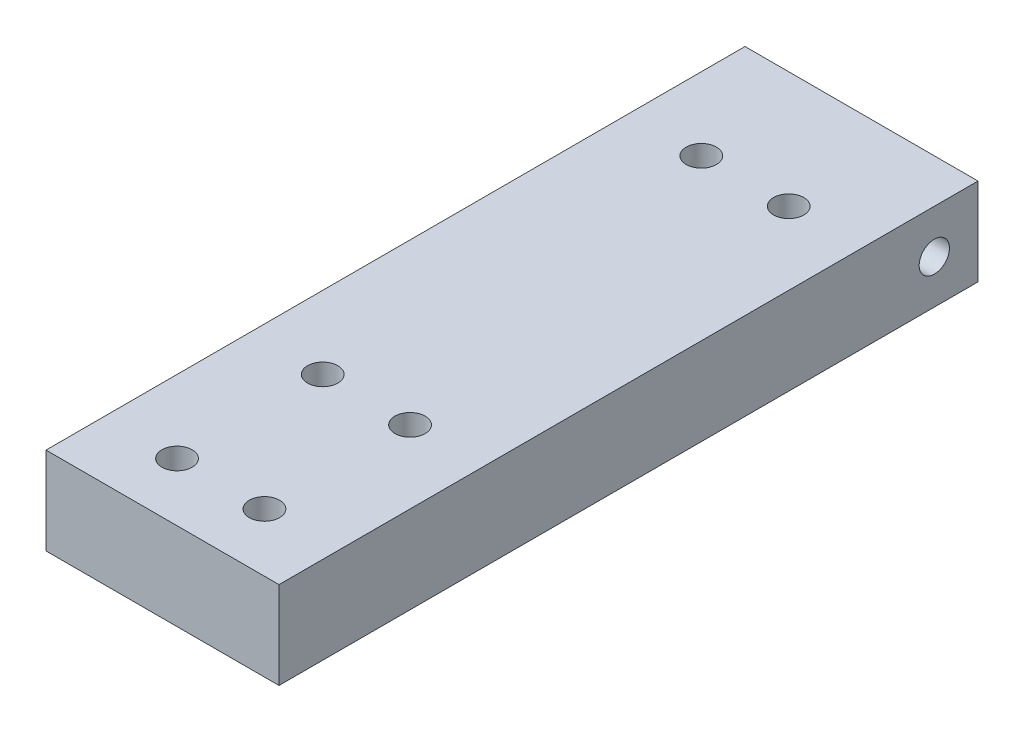
ISO-10303-21;
HEADER;
FILE_DESCRIPTION(('STEP AP214'),'2;1');
FILE_NAME('part.step','',(''),(''),'','','');
FILE_SCHEMA(('AUTOMOTIVE_DESIGN { 1 0 10303 214 1 1 1 1 }'));
ENDSEC;
DATA;
#1=APPLICATION_CONTEXT('core data for automotive mechanical design processes');
#2=APPLICATION_PROTOCOL_DEFINITION('international standard','automotive_design',2000,#1);
#3=PRODUCT_CONTEXT('',#1,'mechanical');
#4=PRODUCT('Part','Part','',(#3));
#5=PRODUCT_RELATED_PRODUCT_CATEGORY('part','',(#4));
#6=PRODUCT_DEFINITION_FORMATION('','',#4);
#7=PRODUCT_DEFINITION_CONTEXT('part definition',#1,'design');
#8=PRODUCT_DEFINITION('design','',#6,#7);
#9=PRODUCT_DEFINITION_SHAPE('','',#8);
#10=(LENGTH_UNIT() NAMED_UNIT(*) SI_UNIT(.MILLI.,.METRE.));
#11=(NAMED_UNIT(*) PLANE_ANGLE_UNIT() SI_UNIT($,.RADIAN.));
#12=(NAMED_UNIT(*) SI_UNIT($,.STERADIAN.) SOLID_ANGLE_UNIT());
#13=UNCERTAINTY_MEASURE_WITH_UNIT(LENGTH_MEASURE(1.E-05),#10,'distance_accuracy_value','');
#14=(GEOMETRIC_REPRESENTATION_CONTEXT(3) GLOBAL_UNCERTAINTY_ASSIGNED_CONTEXT((#13)) GLOBAL_UNIT_ASSIGNED_CONTEXT((#10,
#11,#12)) REPRESENTATION_CONTEXT('',''));
#15=CARTESIAN_POINT('',(0.,0.,0.));
#16=DIRECTION('',(0.,0.,1.));
#17=DIRECTION('',(1.,0.,0.));
#18=AXIS2_PLACEMENT_3D('',#15,#16,#17);
#19=CARTESIAN_POINT('',(0.,0.,152.4));
#20=DIRECTION('',(1.,0.,0.));
#21=DIRECTION('',(0.,0.,-1.));
#22=AXIS2_PLACEMENT_3D('',#19,#20,#21);
#23=PLANE('',#22);
#24=CARTESIAN_POINT('',(0.,9.525,9.525));
#25=DIRECTION('',(-1.,0.,0.));
#26=DIRECTION('',(0.,0.,1.));
#27=AXIS2_PLACEMENT_3D('',#24,#25,#26);
#28=CIRCLE('',#27,3.29999999999999);
#29=CARTESIAN_POINT('',(0.,9.525,12.825));
#30=VERTEX_POINT('',#29);
#31=EDGE_CURVE('E162',#30,#30,#28,.T.);
#32=ORIENTED_EDGE('',*,*,#31,.F.);
#33=EDGE_LOOP('',(#32));
#34=FACE_BOUND('',#33,.T.);
#35=DIRECTION('',(0.,-1.,0.));
#36=VECTOR('',#35,1.);
#37=CARTESIAN_POINT('',(0.,0.,0.));
#38=LINE('',#37,#36);
#39=CARTESIAN_POINT('',(0.,19.05,0.));
#40=VERTEX_POINT('',#39);
#41=CARTESIAN_POINT('',(0.,0.,0.));
#42=VERTEX_POINT('',#41);
#43=EDGE_CURVE('E98',#40,#42,#38,.T.);
#44=ORIENTED_EDGE('',*,*,#43,.T.);
#45=DIRECTION('',(0.,0.,-1.));
#46=VECTOR('',#45,1.);
#47=CARTESIAN_POINT('',(0.,0.,152.4));
#48=LINE('',#47,#46);
#49=CARTESIAN_POINT('',(0.,0.,152.4));
#50=VERTEX_POINT('',#49);
#51=EDGE_CURVE('E11',#50,#42,#48,.T.);
#52=ORIENTED_EDGE('',*,*,#51,.F.);
#53=DIRECTION('',(0.,-1.,0.));
#54=VECTOR('',#53,1.);
#55=CARTESIAN_POINT('',(0.,0.,152.4));
#56=LINE('',#55,#54);
#57=CARTESIAN_POINT('',(0.,19.05,152.4));
#58=VERTEX_POINT('',#57);
#59=EDGE_CURVE('E86',#58,#50,#56,.T.);
#60=ORIENTED_EDGE('',*,*,#59,.F.);
#61=DIRECTION('',(0.,0.,-1.));
#62=VECTOR('',#61,1.);
#63=CARTESIAN_POINT('',(0.,19.05,152.4));
#64=LINE('',#63,#62);
#65=EDGE_CURVE('E94',#58,#40,#64,.T.);
#66=ORIENTED_EDGE('',*,*,#65,.T.);
#67=EDGE_LOOP('',(#44,#52,#60,#66));
#68=FACE_BOUND('',#67,.T.);
#69=ADVANCED_FACE('F35',(#34,#68),#23,.F.);
#70=CARTESIAN_POINT('',(0.,0.,152.4));
#71=DIRECTION('',(0.,1.,0.));
#72=DIRECTION('',(0.,0.,1.));
#73=AXIS2_PLACEMENT_3D('',#70,#71,#72);
#74=PLANE('',#73);
#75=CARTESIAN_POINT('',(34.925,0.,25.4));
#76=DIRECTION('',(0.,-1.,0.));
#77=DIRECTION('',(0.,0.,-1.));
#78=AXIS2_PLACEMENT_3D('',#75,#76,#77);
#79=CIRCLE('',#78,3.29999999999999);
#80=CARTESIAN_POINT('',(34.925,0.,22.1));
#81=VERTEX_POINT('',#80);
#82=EDGE_CURVE('E174',#81,#81,#79,.T.);
#83=ORIENTED_EDGE('',*,*,#82,.F.);
#84=EDGE_LOOP('',(#83));
#85=FACE_BOUND('',#84,.T.);
#86=CARTESIAN_POINT('',(15.875,0.,25.4));
#87=DIRECTION('',(0.,-1.,0.));
#88=DIRECTION('',(0.,0.,-1.));
#89=AXIS2_PLACEMENT_3D('',#86,#87,#88);
#90=CIRCLE('',#89,3.29999999999999);
#91=CARTESIAN_POINT('',(15.875,0.,22.1));
#92=VERTEX_POINT('',#91);
#93=EDGE_CURVE('E168',#92,#92,#90,.T.);
#94=ORIENTED_EDGE('',*,*,#93,.F.);
#95=EDGE_LOOP('',(#94));
#96=FACE_BOUND('',#95,.T.);
#97=CARTESIAN_POINT('',(34.925,0.,139.7));
#98=DIRECTION('',(0.,-1.,0.));
#99=DIRECTION('',(0.,0.,-1.));
#100=AXIS2_PLACEMENT_3D('',#97,#98,#99);
#101=CIRCLE('',#100,5.5);
#102=CARTESIAN_POINT('',(34.925,0.,134.2));
#103=VERTEX_POINT('',#102);
#104=EDGE_CURVE('E156',#103,#103,#101,.T.);
#105=ORIENTED_EDGE('',*,*,#104,.F.);
#106=EDGE_LOOP('',(#105));
#107=FACE_BOUND('',#106,.T.);
#108=CARTESIAN_POINT('',(34.925,0.,107.95));
#109=DIRECTION('',(0.,-1.,0.));
#110=DIRECTION('',(0.,0.,-1.));
#111=AXIS2_PLACEMENT_3D('',#108,#109,#110);
#112=CIRCLE('',#111,5.5);
#113=CARTESIAN_POINT('',(34.925,0.,102.45));
#114=VERTEX_POINT('',#113);
#115=EDGE_CURVE('E144',#114,#114,#112,.T.);
#116=ORIENTED_EDGE('',*,*,#115,.F.);
#117=EDGE_LOOP('',(#116));
#118=FACE_BOUND('',#117,.T.);
#119=CARTESIAN_POINT('',(15.875,0.,107.95));
#120=DIRECTION('',(0.,-1.,0.));
#121=DIRECTION('',(0.,0.,-1.));
#122=AXIS2_PLACEMENT_3D('',#119,#120,#121);
#123=CIRCLE('',#122,5.5);
#124=CARTESIAN_POINT('',(15.875,0.,102.45));
#125=VERTEX_POINT('',#124);
#126=EDGE_CURVE('E132',#125,#125,#123,.T.);
#127=ORIENTED_EDGE('',*,*,#126,.F.);
#128=EDGE_LOOP('',(#127));
#129=FACE_BOUND('',#128,.T.);
#130=CARTESIAN_POINT('',(15.875,0.,139.7));
#131=DIRECTION('',(0.,-1.,0.));
#132=DIRECTION('',(0.,0.,-1.));
#133=AXIS2_PLACEMENT_3D('',#130,#131,#132);
#134=CIRCLE('',#133,5.5);
#135=CARTESIAN_POINT('',(15.875,0.,134.2));
#136=VERTEX_POINT('',#135);
#137=EDGE_CURVE('E120',#136,#136,#134,.T.);
#138=ORIENTED_EDGE('',*,*,#137,.F.);
#139=EDGE_LOOP('',(#138));
#140=FACE_BOUND('',#139,.T.);
#141=DIRECTION('',(1.,0.,0.));
#142=VECTOR('',#141,1.);
#143=CARTESIAN_POINT('',(0.,0.,0.));
#144=LINE('',#143,#142);
#145=CARTESIAN_POINT('',(50.8,0.,0.));
#146=VERTEX_POINT('',#145);
#147=EDGE_CURVE('E90',#42,#146,#144,.T.);
#148=ORIENTED_EDGE('',*,*,#147,.T.);
#149=DIRECTION('',(0.,0.,-1.));
#150=VECTOR('',#149,1.);
#151=CARTESIAN_POINT('',(50.8,0.,152.4));
#152=LINE('',#151,#150);
#153=CARTESIAN_POINT('',(50.8,0.,152.4));
#154=VERTEX_POINT('',#153);
#155=EDGE_CURVE('E43',#154,#146,#152,.T.);
#156=ORIENTED_EDGE('',*,*,#155,.F.);
#157=DIRECTION('',(1.,0.,0.));
#158=VECTOR('',#157,1.);
#159=CARTESIAN_POINT('',(0.,0.,152.4));
#160=LINE('',#159,#158);
#161=EDGE_CURVE('E81',#50,#154,#160,.T.);
#162=ORIENTED_EDGE('',*,*,#161,.F.);
#163=ORIENTED_EDGE('',*,*,#51,.T.);
#164=EDGE_LOOP('',(#148,#156,#162,#163));
#165=FACE_BOUND('',#164,.T.);
#166=ADVANCED_FACE('F89',(#85,#96,#107,#118,#129,#140,#165),#74,.F.);
#167=CARTESIAN_POINT('',(50.8,0.,152.4));
#168=DIRECTION('',(-1.,0.,0.));
#169=DIRECTION('',(0.,0.,1.));
#170=AXIS2_PLACEMENT_3D('',#167,#168,#169);
#171=PLANE('',#170);
#172=CARTESIAN_POINT('',(50.8,9.525,9.525));
#173=DIRECTION('',(-1.,0.,0.));
#174=DIRECTION('',(0.,0.,1.));
#175=AXIS2_PLACEMENT_3D('',#172,#173,#174);
#176=CIRCLE('',#175,3.29999999999999);
#177=CARTESIAN_POINT('',(50.8,9.525,12.825));
#178=VERTEX_POINT('',#177);
#179=EDGE_CURVE('E159',#178,#178,#176,.T.);
#180=ORIENTED_EDGE('',*,*,#179,.T.);
#181=EDGE_LOOP('',(#180));
#182=FACE_BOUND('',#181,.T.);
#183=DIRECTION('',(0.,1.,0.));
#184=VECTOR('',#183,1.);
#185=CARTESIAN_POINT('',(50.8,0.,0.));
#186=LINE('',#185,#184);
#187=CARTESIAN_POINT('',(50.8,19.05,0.));
#188=VERTEX_POINT('',#187);
#189=EDGE_CURVE('E68',#146,#188,#186,.T.);
#190=ORIENTED_EDGE('',*,*,#189,.T.);
#191=DIRECTION('',(0.,0.,-1.));
#192=VECTOR('',#191,1.);
#193=CARTESIAN_POINT('',(50.8,19.05,152.4));
#194=LINE('',#193,#192);
#195=CARTESIAN_POINT('',(50.8,19.05,152.4));
#196=VERTEX_POINT('',#195);
#197=EDGE_CURVE('E91',#196,#188,#194,.T.);
#198=ORIENTED_EDGE('',*,*,#197,.F.);
#199=DIRECTION('',(0.,1.,0.));
#200=VECTOR('',#199,1.);
#201=CARTESIAN_POINT('',(50.8,0.,152.4));
#202=LINE('',#201,#200);
#203=EDGE_CURVE('E84',#154,#196,#202,.T.);
#204=ORIENTED_EDGE('',*,*,#203,.F.);
#205=ORIENTED_EDGE('',*,*,#155,.T.);
#206=EDGE_LOOP('',(#190,#198,#204,#205));
#207=FACE_BOUND('',#206,.T.);
#208=ADVANCED_FACE('F92',(#182,#207),#171,.F.);
#209=CARTESIAN_POINT('',(0.,19.05,152.4));
#210=DIRECTION('',(0.,-1.,0.));
#211=DIRECTION('',(0.,0.,-1.));
#212=AXIS2_PLACEMENT_3D('',#209,#210,#211);
#213=PLANE('',#212);
#214=CARTESIAN_POINT('',(34.925,19.05,25.4));
#215=DIRECTION('',(0.,-1.,0.));
#216=DIRECTION('',(0.,0.,-1.));
#217=AXIS2_PLACEMENT_3D('',#214,#215,#216);
#218=CIRCLE('',#217,3.3);
#219=CARTESIAN_POINT('',(34.925,19.05,22.1));
#220=VERTEX_POINT('',#219);
#221=EDGE_CURVE('E171',#220,#220,#218,.T.);
#222=ORIENTED_EDGE('',*,*,#221,.T.);
#223=EDGE_LOOP('',(#222));
#224=FACE_BOUND('',#223,.T.);
#225=CARTESIAN_POINT('',(15.875,19.05,25.4));
#226=DIRECTION('',(0.,-1.,0.));
#227=DIRECTION('',(0.,0.,-1.));
#228=AXIS2_PLACEMENT_3D('',#225,#226,#227);
#229=CIRCLE('',#228,3.29999999999999);
#230=CARTESIAN_POINT('',(15.875,19.05,22.1));
#231=VERTEX_POINT('',#230);
#232=EDGE_CURVE('E165',#231,#231,#229,.T.);
#233=ORIENTED_EDGE('',*,*,#232,.T.);
#234=EDGE_LOOP('',(#233));
#235=FACE_BOUND('',#234,.T.);
#236=CARTESIAN_POINT('',(34.925,19.05,139.7));
#237=DIRECTION('',(0.,-1.,0.));
#238=DIRECTION('',(0.,0.,-1.));
#239=AXIS2_PLACEMENT_3D('',#236,#237,#238);
#240=CIRCLE('',#239,3.3);
#241=CARTESIAN_POINT('',(34.925,19.05,136.4));
#242=VERTEX_POINT('',#241);
#243=EDGE_CURVE('E147',#242,#242,#240,.T.);
#244=ORIENTED_EDGE('',*,*,#243,.T.);
#245=EDGE_LOOP('',(#244));
#246=FACE_BOUND('',#245,.T.);
#247=CARTESIAN_POINT('',(34.925,19.05,107.95));
#248=DIRECTION('',(0.,-1.,0.));
#249=DIRECTION('',(0.,0.,-1.));
#250=AXIS2_PLACEMENT_3D('',#247,#248,#249);
#251=CIRCLE('',#250,3.3);
#252=CARTESIAN_POINT('',(34.925,19.05,104.65));
#253=VERTEX_POINT('',#252);
#254=EDGE_CURVE('E135',#253,#253,#251,.T.);
#255=ORIENTED_EDGE('',*,*,#254,.T.);
#256=EDGE_LOOP('',(#255));
#257=FACE_BOUND('',#256,.T.);
#258=CARTESIAN_POINT('',(15.875,19.05,107.95));
#259=DIRECTION('',(0.,-1.,0.));
#260=DIRECTION('',(0.,0.,-1.));
#261=AXIS2_PLACEMENT_3D('',#258,#259,#260);
#262=CIRCLE('',#261,3.3);
#263=CARTESIAN_POINT('',(15.875,19.05,104.65));
#264=VERTEX_POINT('',#263);
#265=EDGE_CURVE('E123',#264,#264,#262,.T.);
#266=ORIENTED_EDGE('',*,*,#265,.T.);
#267=EDGE_LOOP('',(#266));
#268=FACE_BOUND('',#267,.T.);
#269=CARTESIAN_POINT('',(15.875,19.05,139.7));
#270=DIRECTION('',(0.,-1.,0.));
#271=DIRECTION('',(0.,0.,-1.));
#272=AXIS2_PLACEMENT_3D('',#269,#270,#271);
#273=CIRCLE('',#272,3.3);
#274=CARTESIAN_POINT('',(15.875,19.05,136.4));
#275=VERTEX_POINT('',#274);
#276=EDGE_CURVE('E101',#275,#275,#273,.T.);
#277=ORIENTED_EDGE('',*,*,#276,.T.);
#278=EDGE_LOOP('',(#277));
#279=FACE_BOUND('',#278,.T.);
#280=DIRECTION('',(-1.,0.,0.));
#281=VECTOR('',#280,1.);
#282=CARTESIAN_POINT('',(0.,19.05,0.));
#283=LINE('',#282,#281);
#284=EDGE_CURVE('E74',#188,#40,#283,.T.);
#285=ORIENTED_EDGE('',*,*,#284,.T.);
#286=ORIENTED_EDGE('',*,*,#65,.F.);
#287=DIRECTION('',(-1.,0.,0.));
#288=VECTOR('',#287,1.);
#289=CARTESIAN_POINT('',(0.,19.05,152.4));
#290=LINE('',#289,#288);
#291=EDGE_CURVE('E51',#196,#58,#290,.T.);
#292=ORIENTED_EDGE('',*,*,#291,.F.);
#293=ORIENTED_EDGE('',*,*,#197,.T.);
#294=EDGE_LOOP('',(#285,#286,#292,#293));
#295=FACE_BOUND('',#294,.T.);
#296=ADVANCED_FACE('F106',(#224,#235,#246,#257,#268,#279,#295),#213,.F.);
#297=CARTESIAN_POINT('',(0.,0.,152.4));
#298=DIRECTION('',(0.,0.,-1.));
#299=DIRECTION('',(-1.,0.,0.));
#300=AXIS2_PLACEMENT_3D('',#297,#298,#299);
#301=PLANE('',#300);
#302=ORIENTED_EDGE('',*,*,#59,.T.);
#303=ORIENTED_EDGE('',*,*,#161,.T.);
#304=ORIENTED_EDGE('',*,*,#203,.T.);
#305=ORIENTED_EDGE('',*,*,#291,.T.);
#306=EDGE_LOOP('',(#302,#303,#304,#305));
#307=FACE_BOUND('',#306,.T.);
#308=ADVANCED_FACE('F82',(#307),#301,.F.);
#309=CARTESIAN_POINT('',(0.,0.,0.));
#310=DIRECTION('',(0.,0.,-1.));
#311=DIRECTION('',(-1.,0.,0.));
#312=AXIS2_PLACEMENT_3D('',#309,#310,#311);
#313=PLANE('',#312);
#314=ORIENTED_EDGE('',*,*,#43,.F.);
#315=ORIENTED_EDGE('',*,*,#284,.F.);
#316=ORIENTED_EDGE('',*,*,#189,.F.);
#317=ORIENTED_EDGE('',*,*,#147,.F.);
#318=EDGE_LOOP('',(#314,#315,#316,#317));
#319=FACE_BOUND('',#318,.T.);
#320=ADVANCED_FACE('F109',(#319),#313,.T.);
#321=CARTESIAN_POINT('',(15.875,0.,139.7));
#322=DIRECTION('',(0.,-1.,0.));
#323=DIRECTION('',(0.,0.,-1.));
#324=AXIS2_PLACEMENT_3D('',#321,#322,#323);
#325=CYLINDRICAL_SURFACE('',#324,3.3);
#326=ORIENTED_EDGE('',*,*,#276,.F.);
#327=EDGE_LOOP('',(#326));
#328=FACE_BOUND('',#327,.T.);
#329=CARTESIAN_POINT('',(15.875,12.35,139.7));
#330=DIRECTION('',(0.,-1.,0.));
#331=DIRECTION('',(0.,0.,-1.));
#332=AXIS2_PLACEMENT_3D('',#329,#330,#331);
#333=CIRCLE('',#332,3.3);
#334=CARTESIAN_POINT('',(15.875,12.35,136.4));
#335=VERTEX_POINT('',#334);
#336=EDGE_CURVE('E114',#335,#335,#333,.T.);
#337=ORIENTED_EDGE('',*,*,#336,.T.);
#338=EDGE_LOOP('',(#337));
#339=FACE_BOUND('',#338,.T.);
#340=ADVANCED_FACE('F205',(#328,#339),#325,.F.);
#341=CARTESIAN_POINT('',(19.175,12.35,139.7));
#342=DIRECTION('',(0.,1.,0.));
#343=DIRECTION('',(0.,0.,1.));
#344=AXIS2_PLACEMENT_3D('',#341,#342,#343);
#345=PLANE('',#344);
#346=ORIENTED_EDGE('',*,*,#336,.F.);
#347=EDGE_LOOP('',(#346));
#348=FACE_BOUND('',#347,.T.);
#349=CARTESIAN_POINT('',(15.875,12.35,139.7));
#350=DIRECTION('',(0.,-1.,0.));
#351=DIRECTION('',(0.,0.,-1.));
#352=AXIS2_PLACEMENT_3D('',#349,#350,#351);
#353=CIRCLE('',#352,5.49999999999999);
#354=CARTESIAN_POINT('',(15.875,12.35,134.2));
#355=VERTEX_POINT('',#354);
#356=EDGE_CURVE('E117',#355,#355,#353,.T.);
#357=ORIENTED_EDGE('',*,*,#356,.T.);
#358=EDGE_LOOP('',(#357));
#359=FACE_BOUND('',#358,.T.);
#360=ADVANCED_FACE('F195',(#348,#359),#345,.F.);
#361=CARTESIAN_POINT('',(15.875,0.,139.7));
#362=DIRECTION('',(0.,-1.,0.));
#363=DIRECTION('',(0.,0.,-1.));
#364=AXIS2_PLACEMENT_3D('',#361,#362,#363);
#365=CYLINDRICAL_SURFACE('',#364,5.5);
#366=ORIENTED_EDGE('',*,*,#356,.F.);
#367=EDGE_LOOP('',(#366));
#368=FACE_BOUND('',#367,.T.);
#369=ORIENTED_EDGE('',*,*,#137,.T.);
#370=EDGE_LOOP('',(#369));
#371=FACE_BOUND('',#370,.T.);
#372=ADVANCED_FACE('F192',(#368,#371),#365,.F.);
#373=CARTESIAN_POINT('',(15.875,0.,107.95));
#374=DIRECTION('',(0.,-1.,0.));
#375=DIRECTION('',(0.,0.,-1.));
#376=AXIS2_PLACEMENT_3D('',#373,#374,#375);
#377=CYLINDRICAL_SURFACE('',#376,3.3);
#378=ORIENTED_EDGE('',*,*,#265,.F.);
#379=EDGE_LOOP('',(#378));
#380=FACE_BOUND('',#379,.T.);
#381=CARTESIAN_POINT('',(15.875,12.35,107.95));
#382=DIRECTION('',(0.,-1.,0.));
#383=DIRECTION('',(0.,0.,-1.));
#384=AXIS2_PLACEMENT_3D('',#381,#382,#383);
#385=CIRCLE('',#384,3.3);
#386=CARTESIAN_POINT('',(15.875,12.35,104.65));
#387=VERTEX_POINT('',#386);
#388=EDGE_CURVE('E126',#387,#387,#385,.T.);
#389=ORIENTED_EDGE('',*,*,#388,.T.);
#390=EDGE_LOOP('',(#389));
#391=FACE_BOUND('',#390,.T.);
#392=ADVANCED_FACE('F194',(#380,#391),#377,.F.);
#393=CARTESIAN_POINT('',(19.175,12.35,107.95));
#394=DIRECTION('',(0.,1.,0.));
#395=DIRECTION('',(0.,0.,1.));
#396=AXIS2_PLACEMENT_3D('',#393,#394,#395);
#397=PLANE('',#396);
#398=ORIENTED_EDGE('',*,*,#388,.F.);
#399=EDGE_LOOP('',(#398));
#400=FACE_BOUND('',#399,.T.);
#401=CARTESIAN_POINT('',(15.875,12.35,107.95));
#402=DIRECTION('',(0.,-1.,0.));
#403=DIRECTION('',(0.,0.,-1.));
#404=AXIS2_PLACEMENT_3D('',#401,#402,#403);
#405=CIRCLE('',#404,5.49999999999999);
#406=CARTESIAN_POINT('',(15.875,12.35,102.45));
#407=VERTEX_POINT('',#406);
#408=EDGE_CURVE('E129',#407,#407,#405,.T.);
#409=ORIENTED_EDGE('',*,*,#408,.T.);
#410=EDGE_LOOP('',(#409));
#411=FACE_BOUND('',#410,.T.);
#412=ADVANCED_FACE('F202',(#400,#411),#397,.F.);
#413=CARTESIAN_POINT('',(15.875,0.,107.95));
#414=DIRECTION('',(0.,-1.,0.));
#415=DIRECTION('',(0.,0.,-1.));
#416=AXIS2_PLACEMENT_3D('',#413,#414,#415);
#417=CYLINDRICAL_SURFACE('',#416,5.5);
#418=ORIENTED_EDGE('',*,*,#408,.F.);
#419=EDGE_LOOP('',(#418));
#420=FACE_BOUND('',#419,.T.);
#421=ORIENTED_EDGE('',*,*,#126,.T.);
#422=EDGE_LOOP('',(#421));
#423=FACE_BOUND('',#422,.T.);
#424=ADVANCED_FACE('F251',(#420,#423),#417,.F.);
#425=CARTESIAN_POINT('',(34.925,0.,107.95));
#426=DIRECTION('',(0.,-1.,0.));
#427=DIRECTION('',(0.,0.,-1.));
#428=AXIS2_PLACEMENT_3D('',#425,#426,#427);
#429=CYLINDRICAL_SURFACE('',#428,3.3);
#430=ORIENTED_EDGE('',*,*,#254,.F.);
#431=EDGE_LOOP('',(#430));
#432=FACE_BOUND('',#431,.T.);
#433=CARTESIAN_POINT('',(34.925,12.35,107.95));
#434=DIRECTION('',(0.,-1.,0.));
#435=DIRECTION('',(0.,0.,-1.));
#436=AXIS2_PLACEMENT_3D('',#433,#434,#435);
#437=CIRCLE('',#436,3.3);
#438=CARTESIAN_POINT('',(34.925,12.35,104.65));
#439=VERTEX_POINT('',#438);
#440=EDGE_CURVE('E138',#439,#439,#437,.T.);
#441=ORIENTED_EDGE('',*,*,#440,.T.);
#442=EDGE_LOOP('',(#441));
#443=FACE_BOUND('',#442,.T.);
#444=ADVANCED_FACE('F247',(#432,#443),#429,.F.);
#445=CARTESIAN_POINT('',(38.225,12.35,107.95));
#446=DIRECTION('',(0.,1.,0.));
#447=DIRECTION('',(0.,0.,1.));
#448=AXIS2_PLACEMENT_3D('',#445,#446,#447);
#449=PLANE('',#448);
#450=ORIENTED_EDGE('',*,*,#440,.F.);
#451=EDGE_LOOP('',(#450));
#452=FACE_BOUND('',#451,.T.);
#453=CARTESIAN_POINT('',(34.925,12.35,107.95));
#454=DIRECTION('',(0.,-1.,0.));
#455=DIRECTION('',(0.,0.,-1.));
#456=AXIS2_PLACEMENT_3D('',#453,#454,#455);
#457=CIRCLE('',#456,5.5);
#458=CARTESIAN_POINT('',(34.925,12.35,102.45));
#459=VERTEX_POINT('',#458);
#460=EDGE_CURVE('E141',#459,#459,#457,.T.);
#461=ORIENTED_EDGE('',*,*,#460,.T.);
#462=EDGE_LOOP('',(#461));
#463=FACE_BOUND('',#462,.T.);
#464=ADVANCED_FACE('F243',(#452,#463),#449,.F.);
#465=CARTESIAN_POINT('',(34.925,0.,107.95));
#466=DIRECTION('',(0.,-1.,0.));
#467=DIRECTION('',(0.,0.,-1.));
#468=AXIS2_PLACEMENT_3D('',#465,#466,#467);
#469=CYLINDRICAL_SURFACE('',#468,5.5);
#470=ORIENTED_EDGE('',*,*,#460,.F.);
#471=EDGE_LOOP('',(#470));
#472=FACE_BOUND('',#471,.T.);
#473=ORIENTED_EDGE('',*,*,#115,.T.);
#474=EDGE_LOOP('',(#473));
#475=FACE_BOUND('',#474,.T.);
#476=ADVANCED_FACE('F239',(#472,#475),#469,.F.);
#477=CARTESIAN_POINT('',(34.925,0.,139.7));
#478=DIRECTION('',(0.,-1.,0.));
#479=DIRECTION('',(0.,0.,-1.));
#480=AXIS2_PLACEMENT_3D('',#477,#478,#479);
#481=CYLINDRICAL_SURFACE('',#480,3.3);
#482=ORIENTED_EDGE('',*,*,#243,.F.);
#483=EDGE_LOOP('',(#482));
#484=FACE_BOUND('',#483,.T.);
#485=CARTESIAN_POINT('',(34.925,12.35,139.7));
#486=DIRECTION('',(0.,-1.,0.));
#487=DIRECTION('',(0.,0.,-1.));
#488=AXIS2_PLACEMENT_3D('',#485,#486,#487);
#489=CIRCLE('',#488,3.3);
#490=CARTESIAN_POINT('',(34.925,12.35,136.4));
#491=VERTEX_POINT('',#490);
#492=EDGE_CURVE('E150',#491,#491,#489,.T.);
#493=ORIENTED_EDGE('',*,*,#492,.T.);
#494=EDGE_LOOP('',(#493));
#495=FACE_BOUND('',#494,.T.);
#496=ADVANCED_FACE('F235',(#484,#495),#481,.F.);
#497=CARTESIAN_POINT('',(38.225,12.35,139.7));
#498=DIRECTION('',(0.,1.,0.));
#499=DIRECTION('',(0.,0.,1.));
#500=AXIS2_PLACEMENT_3D('',#497,#498,#499);
#501=PLANE('',#500);
#502=ORIENTED_EDGE('',*,*,#492,.F.);
#503=EDGE_LOOP('',(#502));
#504=FACE_BOUND('',#503,.T.);
#505=CARTESIAN_POINT('',(34.925,12.35,139.7));
#506=DIRECTION('',(0.,-1.,0.));
#507=DIRECTION('',(0.,0.,-1.));
#508=AXIS2_PLACEMENT_3D('',#505,#506,#507);
#509=CIRCLE('',#508,5.5);
#510=CARTESIAN_POINT('',(34.925,12.35,134.2));
#511=VERTEX_POINT('',#510);
#512=EDGE_CURVE('E153',#511,#511,#509,.T.);
#513=ORIENTED_EDGE('',*,*,#512,.T.);
#514=EDGE_LOOP('',(#513));
#515=FACE_BOUND('',#514,.T.);
#516=ADVANCED_FACE('F227',(#504,#515),#501,.F.);
#517=CARTESIAN_POINT('',(34.925,0.,139.7));
#518=DIRECTION('',(0.,-1.,0.));
#519=DIRECTION('',(0.,0.,-1.));
#520=AXIS2_PLACEMENT_3D('',#517,#518,#519);
#521=CYLINDRICAL_SURFACE('',#520,5.5);
#522=ORIENTED_EDGE('',*,*,#512,.F.);
#523=EDGE_LOOP('',(#522));
#524=FACE_BOUND('',#523,.T.);
#525=ORIENTED_EDGE('',*,*,#104,.T.);
#526=EDGE_LOOP('',(#525));
#527=FACE_BOUND('',#526,.T.);
#528=ADVANCED_FACE('F218',(#524,#527),#521,.F.);
#529=CARTESIAN_POINT('',(0.,9.525,9.525));
#530=DIRECTION('',(-1.,0.,0.));
#531=DIRECTION('',(0.,0.,1.));
#532=AXIS2_PLACEMENT_3D('',#529,#530,#531);
#533=CYLINDRICAL_SURFACE('',#532,3.29999999999999);
#534=ORIENTED_EDGE('',*,*,#179,.F.);
#535=EDGE_LOOP('',(#534));
#536=FACE_BOUND('',#535,.T.);
#537=ORIENTED_EDGE('',*,*,#31,.T.);
#538=EDGE_LOOP('',(#537));
#539=FACE_BOUND('',#538,.T.);
#540=ADVANCED_FACE('F215',(#536,#539),#533,.F.);
#541=CARTESIAN_POINT('',(15.875,0.,25.4));
#542=DIRECTION('',(0.,-1.,0.));
#543=DIRECTION('',(0.,0.,-1.));
#544=AXIS2_PLACEMENT_3D('',#541,#542,#543);
#545=CYLINDRICAL_SURFACE('',#544,3.29999999999999);
#546=ORIENTED_EDGE('',*,*,#232,.F.);
#547=EDGE_LOOP('',(#546));
#548=FACE_BOUND('',#547,.T.);
#549=ORIENTED_EDGE('',*,*,#93,.T.);
#550=EDGE_LOOP('',(#549));
#551=FACE_BOUND('',#550,.T.);
#552=ADVANCED_FACE('F217',(#548,#551),#545,.F.);
#553=CARTESIAN_POINT('',(34.925,0.,25.4));
#554=DIRECTION('',(0.,-1.,0.));
#555=DIRECTION('',(0.,0.,-1.));
#556=AXIS2_PLACEMENT_3D('',#553,#554,#555);
#557=CYLINDRICAL_SURFACE('',#556,3.29999999999999);
#558=ORIENTED_EDGE('',*,*,#221,.F.);
#559=EDGE_LOOP('',(#558));
#560=FACE_BOUND('',#559,.T.);
#561=ORIENTED_EDGE('',*,*,#82,.T.);
#562=EDGE_LOOP('',(#561));
#563=FACE_BOUND('',#562,.T.);
#564=ADVANCED_FACE('F178',(#560,#563),#557,.F.);
#565=CLOSED_SHELL('',(#69,#166,#208,#296,#308,#320,#340,#360,#372,#392,#412,#424,#444,#464,#476,
#496,#516,#528,#540,#552,#564));
#566=MANIFOLD_SOLID_BREP('B2',#565);
#567=ADVANCED_BREP_SHAPE_REPRESENTATION('',(#18,#566),#14);
#568=SHAPE_DEFINITION_REPRESENTATION(#9,#567);
ENDSEC;
END-ISO-10303-21;
